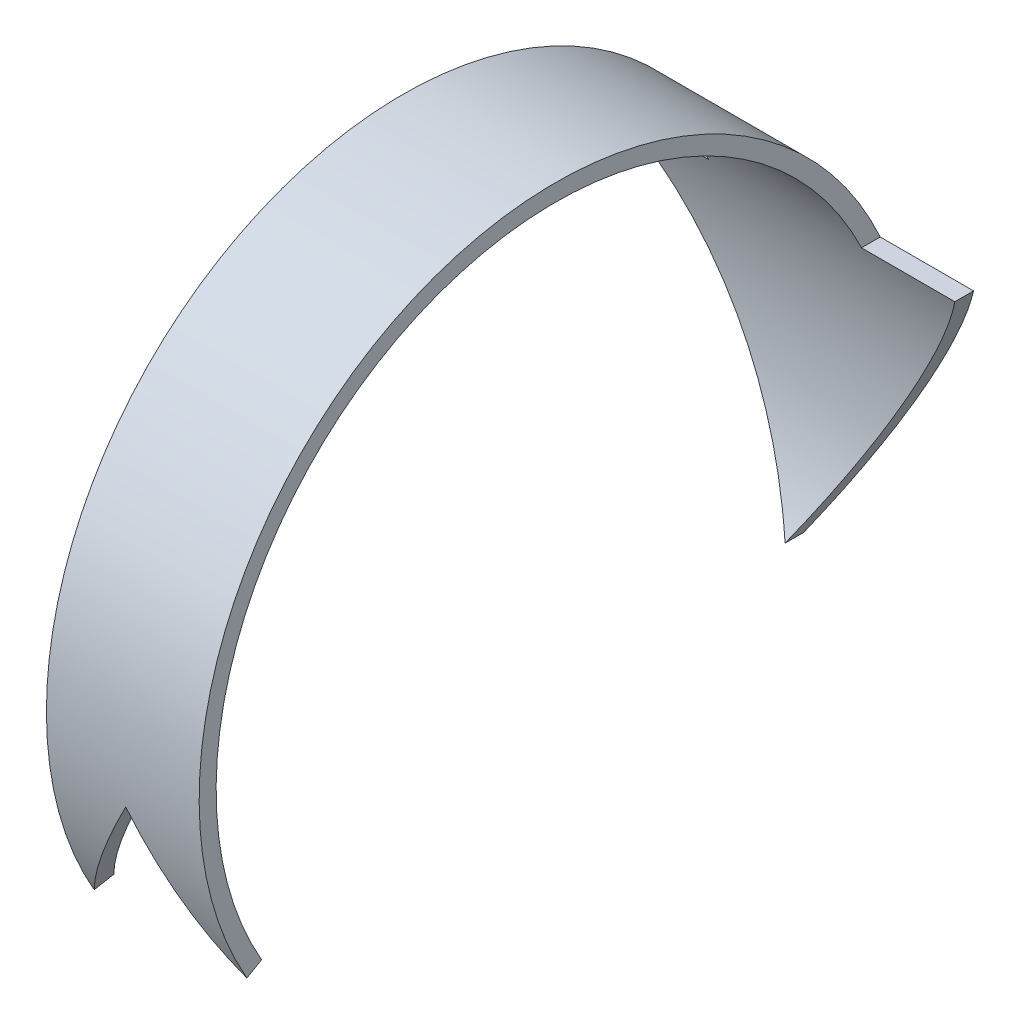
ISO-10303-21;
HEADER;
FILE_DESCRIPTION(('STEP AP214'),'2;1');
FILE_NAME('part.step','',(''),(''),'','','');
FILE_SCHEMA(('AUTOMOTIVE_DESIGN { 1 0 10303 214 1 1 1 1 }'));
ENDSEC;
DATA;
#1=APPLICATION_CONTEXT('core data for automotive mechanical design processes');
#2=APPLICATION_PROTOCOL_DEFINITION('international standard','automotive_design',2000,#1);
#3=PRODUCT_CONTEXT('',#1,'mechanical');
#4=PRODUCT('Part','Part','',(#3));
#5=PRODUCT_RELATED_PRODUCT_CATEGORY('part','',(#4));
#6=PRODUCT_DEFINITION_FORMATION('','',#4);
#7=PRODUCT_DEFINITION_CONTEXT('part definition',#1,'design');
#8=PRODUCT_DEFINITION('design','',#6,#7);
#9=PRODUCT_DEFINITION_SHAPE('','',#8);
#10=(LENGTH_UNIT() NAMED_UNIT(*) SI_UNIT(.MILLI.,.METRE.));
#11=(NAMED_UNIT(*) PLANE_ANGLE_UNIT() SI_UNIT($,.RADIAN.));
#12=(NAMED_UNIT(*) SI_UNIT($,.STERADIAN.) SOLID_ANGLE_UNIT());
#13=UNCERTAINTY_MEASURE_WITH_UNIT(LENGTH_MEASURE(1.E-05),#10,'distance_accuracy_value','');
#14=(GEOMETRIC_REPRESENTATION_CONTEXT(3) GLOBAL_UNCERTAINTY_ASSIGNED_CONTEXT((#13)) GLOBAL_UNIT_ASSIGNED_CONTEXT((#10,
#11,#12)) REPRESENTATION_CONTEXT('',''));
#15=CARTESIAN_POINT('',(0.,0.,0.));
#16=DIRECTION('',(0.,0.,1.));
#17=DIRECTION('',(1.,0.,0.));
#18=AXIS2_PLACEMENT_3D('',#15,#16,#17);
#19=CARTESIAN_POINT('',(-7.5,-7.50000000000006,12.9903810567665));
#20=DIRECTION('',(0.,0.866025403784436,0.500000000000004));
#21=DIRECTION('',(-1.,0.,0.));
#22=AXIS2_PLACEMENT_3D('',#19,#20,#21);
#23=PLANE('',#22);
#24=DIRECTION('',(0.,-0.500000000000004,0.866025403784436));
#25=VECTOR('',#24,1.);
#26=CARTESIAN_POINT('',(3.375,-7.50000000000006,12.9903810567665));
#27=LINE('',#26,#25);
#28=CARTESIAN_POINT('',(3.375,-7.50000000000006,12.9903810567665));
#29=VERTEX_POINT('',#28);
#30=CARTESIAN_POINT('',(3.375,-7.87500000000007,13.6399001096049));
#31=VERTEX_POINT('',#30);
#32=EDGE_CURVE('E124',#29,#31,#27,.T.);
#33=ORIENTED_EDGE('',*,*,#32,.T.);
#34=DIRECTION('',(-0.277350098112615,0.480384461415265,-0.832050294337841));
#35=VECTOR('',#34,1.);
#36=CARTESIAN_POINT('',(2.33860952220358,-6.07991903597608,10.5307286762157));
#37=LINE('',#36,#35);
#38=CARTESIAN_POINT('',(3.15849364905389,-7.50000000000006,12.9903810567665));
#39=VERTEX_POINT('',#38);
#40=EDGE_CURVE('E12',#31,#39,#37,.T.);
#41=ORIENTED_EDGE('',*,*,#40,.T.);
#42=DIRECTION('',(-1.,0.,0.));
#43=VECTOR('',#42,1.);
#44=CARTESIAN_POINT('',(7.5,-7.50000000000006,12.9903810567665));
#45=LINE('',#44,#43);
#46=EDGE_CURVE('E131',#29,#39,#45,.T.);
#47=ORIENTED_EDGE('',*,*,#46,.F.);
#48=EDGE_LOOP('',(#33,#41,#47));
#49=FACE_BOUND('',#48,.T.);
#50=ADVANCED_FACE('F34',(#49),#23,.F.);
#51=CARTESIAN_POINT('',(0.,0.,0.));
#52=DIRECTION('',(-1.,0.,0.));
#53=DIRECTION('',(0.,0.,1.));
#54=AXIS2_PLACEMENT_3D('',#51,#52,#53);
#55=CYLINDRICAL_SURFACE('',#54,15.75);
#56=CARTESIAN_POINT('',(-1.17163336986832,0.,0.));
#57=DIRECTION('',(0.86602540378444,0.499999999999998,0.));
#58=DIRECTION('',(-0.499999999999998,0.86602540378444,0.));
#59=AXIS2_PLACEMENT_3D('',#56,#57,#58);
#60=ELLIPSE('',#59,18.1865334794732,15.75);
#61=CARTESIAN_POINT('',(0.,-2.02932852445508,15.6187171605044));
#62=VERTEX_POINT('',#61);
#63=EDGE_CURVE('E165',#31,#62,#60,.F.);
#64=ORIENTED_EDGE('',*,*,#63,.F.);
#65=CARTESIAN_POINT('',(3.375,0.,0.));
#66=DIRECTION('',(1.,0.,0.));
#67=DIRECTION('',(0.,0.,-1.));
#68=AXIS2_PLACEMENT_3D('',#65,#66,#67);
#69=CIRCLE('',#68,15.75);
#70=CARTESIAN_POINT('',(3.375,6.49038105676661,-14.3505210267072));
#71=VERTEX_POINT('',#70);
#72=EDGE_CURVE('E135',#31,#71,#69,.F.);
#73=ORIENTED_EDGE('',*,*,#72,.T.);
#74=DIRECTION('',(-1.,0.,0.));
#75=VECTOR('',#74,1.);
#76=CARTESIAN_POINT('',(0.,6.49038105676663,-14.3505210267072));
#77=LINE('',#76,#75);
#78=CARTESIAN_POINT('',(7.5,6.49038105676658,-14.3505210267072));
#79=VERTEX_POINT('',#78);
#80=EDGE_CURVE('E190',#71,#79,#77,.F.);
#81=ORIENTED_EDGE('',*,*,#80,.T.);
#82=CARTESIAN_POINT('',(3.75277674973258,0.,0.));
#83=DIRECTION('',(0.86602540378444,-0.499999999999998,0.));
#84=DIRECTION('',(-0.499999999999998,-0.86602540378444,0.));
#85=AXIS2_PLACEMENT_3D('',#82,#83,#84);
#86=ELLIPSE('',#85,18.1865334794732,15.75);
#87=CARTESIAN_POINT('',(0.,-6.50000000000006,-14.3461667354036));
#88=VERTEX_POINT('',#87);
#89=EDGE_CURVE('E188',#79,#88,#86,.F.);
#90=ORIENTED_EDGE('',*,*,#89,.T.);
#91=CARTESIAN_POINT('',(-3.75277674973258,0.,0.));
#92=DIRECTION('',(-0.86602540378444,-0.499999999999998,0.));
#93=DIRECTION('',(-0.499999999999998,0.86602540378444,0.));
#94=AXIS2_PLACEMENT_3D('',#91,#92,#93);
#95=ELLIPSE('',#94,18.1865334794732,15.75);
#96=CARTESIAN_POINT('',(-7.5,6.49038105676661,-14.3505210267072));
#97=VERTEX_POINT('',#96);
#98=EDGE_CURVE('E186',#88,#97,#95,.F.);
#99=ORIENTED_EDGE('',*,*,#98,.T.);
#100=DIRECTION('',(-1.,0.,0.));
#101=VECTOR('',#100,1.);
#102=CARTESIAN_POINT('',(0.,6.49038105676661,-14.3505210267072));
#103=LINE('',#102,#101);
#104=CARTESIAN_POINT('',(-3.375,6.49038105676661,-14.3505210267072));
#105=VERTEX_POINT('',#104);
#106=EDGE_CURVE('E176',#97,#105,#103,.F.);
#107=ORIENTED_EDGE('',*,*,#106,.T.);
#108=CARTESIAN_POINT('',(-3.375,0.,0.));
#109=DIRECTION('',(-1.,0.,0.));
#110=DIRECTION('',(0.,0.,1.));
#111=AXIS2_PLACEMENT_3D('',#108,#109,#110);
#112=CIRCLE('',#111,15.75);
#113=CARTESIAN_POINT('',(-3.375,-7.87500000000007,13.6399001096049));
#114=VERTEX_POINT('',#113);
#115=EDGE_CURVE('E49',#105,#114,#112,.F.);
#116=ORIENTED_EDGE('',*,*,#115,.T.);
#117=CARTESIAN_POINT('',(1.17163336986832,0.,0.));
#118=DIRECTION('',(-0.86602540378444,0.499999999999998,0.));
#119=DIRECTION('',(-0.499999999999998,-0.86602540378444,0.));
#120=AXIS2_PLACEMENT_3D('',#117,#118,#119);
#121=ELLIPSE('',#120,18.1865334794732,15.75);
#122=EDGE_CURVE('E168',#62,#114,#121,.F.);
#123=ORIENTED_EDGE('',*,*,#122,.F.);
#124=EDGE_LOOP('',(#64,#73,#81,#90,#99,#107,#116,#123));
#125=FACE_BOUND('',#124,.T.);
#126=ADVANCED_FACE('F36',(#125),#55,.T.);
#127=CARTESIAN_POINT('',(0.,0.,0.));
#128=DIRECTION('',(-1.,0.,0.));
#129=DIRECTION('',(0.,0.,1.));
#130=AXIS2_PLACEMENT_3D('',#127,#128,#129);
#131=CYLINDRICAL_SURFACE('',#130,15.);
#132=CARTESIAN_POINT('',(1.17163336986832,0.,0.));
#133=DIRECTION('',(-0.86602540378444,0.499999999999998,0.));
#134=DIRECTION('',(-0.499999999999998,-0.86602540378444,0.));
#135=AXIS2_PLACEMENT_3D('',#132,#133,#134);
#136=ELLIPSE('',#135,17.3205080756887,15.);
#137=CARTESIAN_POINT('',(-3.15849364905389,-7.50000000000006,12.9903810567665));
#138=VERTEX_POINT('',#137);
#139=CARTESIAN_POINT('',(0.,-2.02932852445508,14.8620935853544));
#140=VERTEX_POINT('',#139);
#141=EDGE_CURVE('E130',#138,#140,#136,.T.);
#142=ORIENTED_EDGE('',*,*,#141,.F.);
#143=CARTESIAN_POINT('',(-3.375,-7.50000000000006,12.9903810567665));
#144=VERTEX_POINT('',#143);
#145=EDGE_CURVE('E123',#138,#144,#45,.T.);
#146=ORIENTED_EDGE('',*,*,#145,.T.);
#147=CARTESIAN_POINT('',(-3.375,0.,0.));
#148=DIRECTION('',(-1.,0.,0.));
#149=DIRECTION('',(0.,0.,1.));
#150=AXIS2_PLACEMENT_3D('',#147,#148,#149);
#151=CIRCLE('',#150,15.);
#152=CARTESIAN_POINT('',(-3.375,6.49038105676661,-13.5231266258201));
#153=VERTEX_POINT('',#152);
#154=EDGE_CURVE('E107',#144,#153,#151,.T.);
#155=ORIENTED_EDGE('',*,*,#154,.T.);
#156=DIRECTION('',(-1.,0.,0.));
#157=VECTOR('',#156,1.);
#158=CARTESIAN_POINT('',(0.,6.49038105676661,-13.5231266258201));
#159=LINE('',#158,#157);
#160=CARTESIAN_POINT('',(-7.5,6.49038105676661,-13.5231266258201));
#161=VERTEX_POINT('',#160);
#162=EDGE_CURVE('E134',#153,#161,#159,.T.);
#163=ORIENTED_EDGE('',*,*,#162,.T.);
#164=CARTESIAN_POINT('',(-3.75277674973258,0.,0.));
#165=DIRECTION('',(-0.86602540378444,-0.499999999999998,0.));
#166=DIRECTION('',(-0.499999999999998,0.86602540378444,0.));
#167=AXIS2_PLACEMENT_3D('',#164,#165,#166);
#168=ELLIPSE('',#167,17.3205080756887,15.);
#169=CARTESIAN_POINT('',(0.,-6.50000000000006,-13.5185058345958));
#170=VERTEX_POINT('',#169);
#171=EDGE_CURVE('E140',#161,#170,#168,.T.);
#172=ORIENTED_EDGE('',*,*,#171,.T.);
#173=CARTESIAN_POINT('',(3.75277674973258,0.,0.));
#174=DIRECTION('',(0.86602540378444,-0.499999999999998,0.));
#175=DIRECTION('',(-0.499999999999998,-0.86602540378444,0.));
#176=AXIS2_PLACEMENT_3D('',#173,#174,#175);
#177=ELLIPSE('',#176,17.3205080756888,15.);
#178=CARTESIAN_POINT('',(7.5,6.49038105676658,-13.5231266258201));
#179=VERTEX_POINT('',#178);
#180=EDGE_CURVE('E143',#170,#179,#177,.T.);
#181=ORIENTED_EDGE('',*,*,#180,.T.);
#182=DIRECTION('',(-1.,0.,0.));
#183=VECTOR('',#182,1.);
#184=CARTESIAN_POINT('',(0.,6.49038105676663,-13.5231266258201));
#185=LINE('',#184,#183);
#186=CARTESIAN_POINT('',(3.375,6.49038105676661,-13.5231266258201));
#187=VERTEX_POINT('',#186);
#188=EDGE_CURVE('E146',#179,#187,#185,.T.);
#189=ORIENTED_EDGE('',*,*,#188,.T.);
#190=CARTESIAN_POINT('',(3.375,0.,0.));
#191=DIRECTION('',(1.,0.,0.));
#192=DIRECTION('',(0.,0.,-1.));
#193=AXIS2_PLACEMENT_3D('',#190,#191,#192);
#194=CIRCLE('',#193,15.);
#195=EDGE_CURVE('E117',#187,#29,#194,.T.);
#196=ORIENTED_EDGE('',*,*,#195,.T.);
#197=ORIENTED_EDGE('',*,*,#46,.T.);
#198=CARTESIAN_POINT('',(-1.17163336986832,0.,0.));
#199=DIRECTION('',(0.86602540378444,0.499999999999998,0.));
#200=DIRECTION('',(-0.499999999999998,0.86602540378444,0.));
#201=AXIS2_PLACEMENT_3D('',#198,#199,#200);
#202=ELLIPSE('',#201,17.3205080756887,15.);
#203=EDGE_CURVE('E159',#140,#39,#202,.T.);
#204=ORIENTED_EDGE('',*,*,#203,.F.);
#205=EDGE_LOOP('',(#142,#146,#155,#163,#172,#181,#189,#196,#197,#204));
#206=FACE_BOUND('',#205,.T.);
#207=ADVANCED_FACE('F128',(#206),#131,.F.);
#208=ORIENTED_EDGE('',*,*,#145,.F.);
#209=DIRECTION('',(-0.277350098112615,-0.480384461415265,0.832050294337841));
#210=VECTOR('',#209,1.);
#211=CARTESIAN_POINT('',(-3.49245567604975,-8.07843919855558,13.9922671377541));
#212=LINE('',#211,#210);
#213=EDGE_CURVE('E42',#138,#114,#212,.T.);
#214=ORIENTED_EDGE('',*,*,#213,.T.);
#215=DIRECTION('',(0.,0.500000000000004,-0.866025403784436));
#216=VECTOR('',#215,1.);
#217=CARTESIAN_POINT('',(-3.375,-7.50000000000006,12.9903810567665));
#218=LINE('',#217,#216);
#219=EDGE_CURVE('E110',#114,#144,#218,.T.);
#220=ORIENTED_EDGE('',*,*,#219,.T.);
#221=EDGE_LOOP('',(#208,#214,#220));
#222=FACE_BOUND('',#221,.T.);
#223=ADVANCED_FACE('F122',(#222),#23,.F.);
#224=CARTESIAN_POINT('',(-3.375,6.49038105676661,-15.75));
#225=DIRECTION('',(-1.,0.,0.));
#226=DIRECTION('',(0.,0.,1.));
#227=AXIS2_PLACEMENT_3D('',#224,#225,#226);
#228=PLANE('',#227);
#229=DIRECTION('',(0.,0.,1.));
#230=VECTOR('',#229,1.);
#231=CARTESIAN_POINT('',(-3.375,6.49038105676661,-15.75));
#232=LINE('',#231,#230);
#233=EDGE_CURVE('E113',#105,#153,#232,.T.);
#234=ORIENTED_EDGE('',*,*,#233,.T.);
#235=ORIENTED_EDGE('',*,*,#154,.F.);
#236=ORIENTED_EDGE('',*,*,#219,.F.);
#237=ORIENTED_EDGE('',*,*,#115,.F.);
#238=EDGE_LOOP('',(#234,#235,#236,#237));
#239=FACE_BOUND('',#238,.T.);
#240=ADVANCED_FACE('F109',(#239),#228,.T.);
#241=CARTESIAN_POINT('',(3.375,15.75,-15.75));
#242=DIRECTION('',(1.,0.,0.));
#243=DIRECTION('',(0.,0.,-1.));
#244=AXIS2_PLACEMENT_3D('',#241,#242,#243);
#245=PLANE('',#244);
#246=ORIENTED_EDGE('',*,*,#72,.F.);
#247=ORIENTED_EDGE('',*,*,#32,.F.);
#248=ORIENTED_EDGE('',*,*,#195,.F.);
#249=DIRECTION('',(0.,0.,1.));
#250=VECTOR('',#249,1.);
#251=CARTESIAN_POINT('',(3.375,6.49038105676661,-15.75));
#252=LINE('',#251,#250);
#253=EDGE_CURVE('E174',#71,#187,#252,.T.);
#254=ORIENTED_EDGE('',*,*,#253,.F.);
#255=EDGE_LOOP('',(#246,#247,#248,#254));
#256=FACE_BOUND('',#255,.T.);
#257=ADVANCED_FACE('F155',(#256),#245,.T.);
#258=CARTESIAN_POINT('',(3.375,6.49038105676661,-15.75));
#259=DIRECTION('',(0.,1.,0.));
#260=DIRECTION('',(-1.,0.,0.));
#261=AXIS2_PLACEMENT_3D('',#258,#259,#260);
#262=PLANE('',#261);
#263=ORIENTED_EDGE('',*,*,#253,.T.);
#264=ORIENTED_EDGE('',*,*,#188,.F.);
#265=DIRECTION('',(0.,0.,1.));
#266=VECTOR('',#265,1.);
#267=CARTESIAN_POINT('',(7.5,6.49038105676658,-15.75));
#268=LINE('',#267,#266);
#269=EDGE_CURVE('E177',#79,#179,#268,.T.);
#270=ORIENTED_EDGE('',*,*,#269,.F.);
#271=ORIENTED_EDGE('',*,*,#80,.F.);
#272=EDGE_LOOP('',(#263,#264,#270,#271));
#273=FACE_BOUND('',#272,.T.);
#274=ADVANCED_FACE('F194',(#273),#262,.T.);
#275=CARTESIAN_POINT('',(7.5,6.49038105676658,-15.75));
#276=DIRECTION('',(0.86602540378444,-0.499999999999998,0.));
#277=DIRECTION('',(0.499999999999998,0.86602540378444,0.));
#278=AXIS2_PLACEMENT_3D('',#275,#276,#277);
#279=PLANE('',#278);
#280=ORIENTED_EDGE('',*,*,#269,.T.);
#281=ORIENTED_EDGE('',*,*,#180,.F.);
#282=DIRECTION('',(0.,0.,1.));
#283=VECTOR('',#282,1.);
#284=CARTESIAN_POINT('',(0.,-6.50000000000006,-15.75));
#285=LINE('',#284,#283);
#286=EDGE_CURVE('E180',#88,#170,#285,.T.);
#287=ORIENTED_EDGE('',*,*,#286,.F.);
#288=ORIENTED_EDGE('',*,*,#89,.F.);
#289=EDGE_LOOP('',(#280,#281,#287,#288));
#290=FACE_BOUND('',#289,.T.);
#291=ADVANCED_FACE('F196',(#290),#279,.T.);
#292=CARTESIAN_POINT('',(0.,-6.50000000000006,-15.75));
#293=DIRECTION('',(-0.86602540378444,-0.499999999999998,0.));
#294=DIRECTION('',(0.499999999999998,-0.86602540378444,0.));
#295=AXIS2_PLACEMENT_3D('',#292,#293,#294);
#296=PLANE('',#295);
#297=ORIENTED_EDGE('',*,*,#286,.T.);
#298=ORIENTED_EDGE('',*,*,#171,.F.);
#299=DIRECTION('',(0.,0.,1.));
#300=VECTOR('',#299,1.);
#301=CARTESIAN_POINT('',(-7.5,6.49038105676661,-15.75));
#302=LINE('',#301,#300);
#303=EDGE_CURVE('E57',#97,#161,#302,.T.);
#304=ORIENTED_EDGE('',*,*,#303,.F.);
#305=ORIENTED_EDGE('',*,*,#98,.F.);
#306=EDGE_LOOP('',(#297,#298,#304,#305));
#307=FACE_BOUND('',#306,.T.);
#308=ADVANCED_FACE('F199',(#307),#296,.T.);
#309=CARTESIAN_POINT('',(-7.5,6.49038105676661,-15.75));
#310=DIRECTION('',(0.,1.,0.));
#311=DIRECTION('',(0.,0.,1.));
#312=AXIS2_PLACEMENT_3D('',#309,#310,#311);
#313=PLANE('',#312);
#314=ORIENTED_EDGE('',*,*,#303,.T.);
#315=ORIENTED_EDGE('',*,*,#162,.F.);
#316=ORIENTED_EDGE('',*,*,#233,.F.);
#317=ORIENTED_EDGE('',*,*,#106,.F.);
#318=EDGE_LOOP('',(#314,#315,#316,#317));
#319=FACE_BOUND('',#318,.T.);
#320=ADVANCED_FACE('F200',(#319),#313,.T.);
#321=CARTESIAN_POINT('',(0.,-2.02932852445508,15.75));
#322=DIRECTION('',(-0.86602540378444,0.499999999999998,0.));
#323=DIRECTION('',(-0.499999999999998,-0.86602540378444,0.));
#324=AXIS2_PLACEMENT_3D('',#321,#322,#323);
#325=PLANE('',#324);
#326=ORIENTED_EDGE('',*,*,#122,.T.);
#327=ORIENTED_EDGE('',*,*,#213,.F.);
#328=ORIENTED_EDGE('',*,*,#141,.T.);
#329=DIRECTION('',(0.,0.,-1.));
#330=VECTOR('',#329,1.);
#331=CARTESIAN_POINT('',(0.,-2.02932852445508,15.75));
#332=LINE('',#331,#330);
#333=EDGE_CURVE('E125',#62,#140,#332,.T.);
#334=ORIENTED_EDGE('',*,*,#333,.F.);
#335=EDGE_LOOP('',(#326,#327,#328,#334));
#336=FACE_BOUND('',#335,.T.);
#337=ADVANCED_FACE('F202',(#336),#325,.F.);
#338=CARTESIAN_POINT('',(0.,-2.02932852445508,15.75));
#339=DIRECTION('',(0.86602540378444,0.499999999999998,0.));
#340=DIRECTION('',(-0.499999999999998,0.86602540378444,0.));
#341=AXIS2_PLACEMENT_3D('',#338,#339,#340);
#342=PLANE('',#341);
#343=ORIENTED_EDGE('',*,*,#63,.T.);
#344=ORIENTED_EDGE('',*,*,#333,.T.);
#345=ORIENTED_EDGE('',*,*,#203,.T.);
#346=ORIENTED_EDGE('',*,*,#40,.F.);
#347=EDGE_LOOP('',(#343,#344,#345,#346));
#348=FACE_BOUND('',#347,.T.);
#349=ADVANCED_FACE('F163',(#348),#342,.F.);
#350=CLOSED_SHELL('',(#50,#126,#207,#223,#240,#257,#274,#291,#308,#320,#337,#349));
#351=MANIFOLD_SOLID_BREP('B2',#350);
#352=ADVANCED_BREP_SHAPE_REPRESENTATION('',(#18,#351),#14);
#353=SHAPE_DEFINITION_REPRESENTATION(#9,#352);
ENDSEC;
END-ISO-10303-21;
